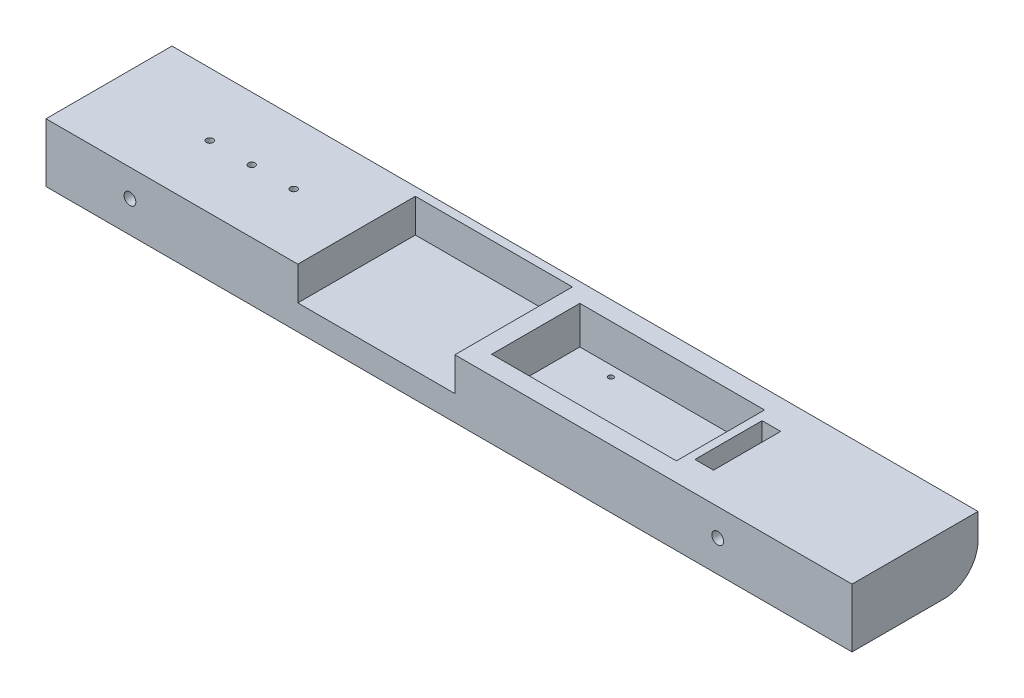
ISO-10303-21;
HEADER;
FILE_DESCRIPTION(('STEP AP214'),'2;1');
FILE_NAME('part.step','',(''),(''),'','','');
FILE_SCHEMA(('AUTOMOTIVE_DESIGN { 1 0 10303 214 1 1 1 1 }'));
ENDSEC;
DATA;
#1=APPLICATION_CONTEXT('core data for automotive mechanical design processes');
#2=APPLICATION_PROTOCOL_DEFINITION('international standard','automotive_design',2000,#1);
#3=PRODUCT_CONTEXT('',#1,'mechanical');
#4=PRODUCT('Part','Part','',(#3));
#5=PRODUCT_RELATED_PRODUCT_CATEGORY('part','',(#4));
#6=PRODUCT_DEFINITION_FORMATION('','',#4);
#7=PRODUCT_DEFINITION_CONTEXT('part definition',#1,'design');
#8=PRODUCT_DEFINITION('design','',#6,#7);
#9=PRODUCT_DEFINITION_SHAPE('','',#8);
#10=(LENGTH_UNIT() NAMED_UNIT(*) SI_UNIT(.MILLI.,.METRE.));
#11=(NAMED_UNIT(*) PLANE_ANGLE_UNIT() SI_UNIT($,.RADIAN.));
#12=(NAMED_UNIT(*) SI_UNIT($,.STERADIAN.) SOLID_ANGLE_UNIT());
#13=UNCERTAINTY_MEASURE_WITH_UNIT(LENGTH_MEASURE(1.E-05),#10,'distance_accuracy_value','');
#14=(GEOMETRIC_REPRESENTATION_CONTEXT(3) GLOBAL_UNCERTAINTY_ASSIGNED_CONTEXT((#13)) GLOBAL_UNIT_ASSIGNED_CONTEXT((#10,
#11,#12)) REPRESENTATION_CONTEXT('',''));
#15=CARTESIAN_POINT('',(0.,0.,0.));
#16=DIRECTION('',(0.,0.,1.));
#17=DIRECTION('',(1.,0.,0.));
#18=AXIS2_PLACEMENT_3D('',#15,#16,#17);
#19=CARTESIAN_POINT('',(243.84,-7.62,-27.94));
#20=DIRECTION('',(-1.,0.,0.));
#21=DIRECTION('',(0.,0.,1.));
#22=AXIS2_PLACEMENT_3D('',#19,#20,#21);
#23=CYLINDRICAL_SURFACE('',#22,10.16);
#24=DIRECTION('',(-1.,0.,0.));
#25=VECTOR('',#24,1.);
#26=CARTESIAN_POINT('',(243.84,-7.61999999999999,-38.1));
#27=LINE('',#26,#25);
#28=CARTESIAN_POINT('',(139.788543672477,-7.62,-38.1));
#29=VERTEX_POINT('',#28);
#30=CARTESIAN_POINT('',(0.,-7.61999999999999,-38.1));
#31=VERTEX_POINT('',#30);
#32=EDGE_CURVE('E406',#29,#31,#27,.T.);
#33=ORIENTED_EDGE('',*,*,#32,.F.);
#34=CARTESIAN_POINT('',(139.788543672477,-7.62,-27.94));
#35=DIRECTION('',(-1.,0.,0.));
#36=DIRECTION('',(0.,0.,-1.));
#37=AXIS2_PLACEMENT_3D('',#34,#35,#36);
#38=CIRCLE('',#37,10.16);
#39=CARTESIAN_POINT('',(139.788543672477,-17.78,-27.94));
#40=VERTEX_POINT('',#39);
#41=EDGE_CURVE('E229',#29,#40,#38,.T.);
#42=ORIENTED_EDGE('',*,*,#41,.T.);
#43=DIRECTION('',(-1.,0.,0.));
#44=VECTOR('',#43,1.);
#45=CARTESIAN_POINT('',(243.84,-17.78,-27.94));
#46=LINE('',#45,#44);
#47=CARTESIAN_POINT('',(0.,-17.78,-27.94));
#48=VERTEX_POINT('',#47);
#49=EDGE_CURVE('E204',#48,#40,#46,.F.);
#50=ORIENTED_EDGE('',*,*,#49,.F.);
#51=CARTESIAN_POINT('',(0.,-7.62,-27.94));
#52=DIRECTION('',(1.,0.,0.));
#53=DIRECTION('',(0.,0.,-1.));
#54=AXIS2_PLACEMENT_3D('',#51,#52,#53);
#55=CIRCLE('',#54,10.16);
#56=EDGE_CURVE('E208',#31,#48,#55,.F.);
#57=ORIENTED_EDGE('',*,*,#56,.F.);
#58=EDGE_LOOP('',(#33,#42,#50,#57));
#59=FACE_BOUND('',#58,.T.);
#60=ADVANCED_FACE('F33',(#59),#23,.T.);
#61=CARTESIAN_POINT('',(30.48,-10.16,-19.05));
#62=DIRECTION('',(0.,1.,0.));
#63=DIRECTION('',(0.,0.,1.));
#64=AXIS2_PLACEMENT_3D('',#61,#62,#63);
#65=PLANE('',#64);
#66=CARTESIAN_POINT('',(30.48,-10.16,-19.05));
#67=DIRECTION('',(0.,1.,0.));
#68=DIRECTION('',(0.,0.,1.));
#69=AXIS2_PLACEMENT_3D('',#66,#67,#68);
#70=CIRCLE('',#69,1.016);
#71=CARTESIAN_POINT('',(30.48,-10.16,-18.034));
#72=VERTEX_POINT('',#71);
#73=EDGE_CURVE('E403',#72,#72,#70,.T.);
#74=ORIENTED_EDGE('',*,*,#73,.T.);
#75=EDGE_LOOP('',(#74));
#76=FACE_BOUND('',#75,.T.);
#77=ADVANCED_FACE('F448',(#76),#65,.T.);
#78=CARTESIAN_POINT('',(30.48,-10.16,-19.05));
#79=DIRECTION('',(0.,1.,0.));
#80=DIRECTION('',(0.,0.,1.));
#81=AXIS2_PLACEMENT_3D('',#78,#79,#80);
#82=CYLINDRICAL_SURFACE('',#81,1.016);
#83=ORIENTED_EDGE('',*,*,#73,.F.);
#84=EDGE_LOOP('',(#83));
#85=FACE_BOUND('',#84,.T.);
#86=CARTESIAN_POINT('',(30.48,0.,-19.05));
#87=DIRECTION('',(0.,1.,0.));
#88=DIRECTION('',(0.,0.,1.));
#89=AXIS2_PLACEMENT_3D('',#86,#87,#88);
#90=CIRCLE('',#89,1.016);
#91=CARTESIAN_POINT('',(30.48,0.,-18.034));
#92=VERTEX_POINT('',#91);
#93=EDGE_CURVE('E400',#92,#92,#90,.T.);
#94=ORIENTED_EDGE('',*,*,#93,.T.);
#95=EDGE_LOOP('',(#94));
#96=FACE_BOUND('',#95,.T.);
#97=ADVANCED_FACE('F452',(#85,#96),#82,.F.);
#98=CARTESIAN_POINT('',(243.84,0.,0.));
#99=DIRECTION('',(0.,0.,-1.));
#100=DIRECTION('',(-1.,0.,0.));
#101=AXIS2_PLACEMENT_3D('',#98,#99,#100);
#102=PLANE('',#101);
#103=CARTESIAN_POINT('',(25.4,-8.25500000000002,0.));
#104=DIRECTION('',(0.,0.,1.));
#105=DIRECTION('',(1.,0.,0.));
#106=AXIS2_PLACEMENT_3D('',#103,#104,#105);
#107=CIRCLE('',#106,1.778);
#108=CARTESIAN_POINT('',(27.178,-8.25500000000002,0.));
#109=VERTEX_POINT('',#108);
#110=EDGE_CURVE('E301',#109,#109,#107,.T.);
#111=ORIENTED_EDGE('',*,*,#110,.F.);
#112=EDGE_LOOP('',(#111));
#113=FACE_BOUND('',#112,.T.);
#114=CARTESIAN_POINT('',(203.2,-8.25500000000002,0.));
#115=DIRECTION('',(0.,0.,1.));
#116=DIRECTION('',(1.,0.,0.));
#117=AXIS2_PLACEMENT_3D('',#114,#115,#116);
#118=CIRCLE('',#117,1.77800000000001);
#119=CARTESIAN_POINT('',(204.978,-8.25500000000002,0.));
#120=VERTEX_POINT('',#119);
#121=EDGE_CURVE('E294',#120,#120,#118,.T.);
#122=ORIENTED_EDGE('',*,*,#121,.F.);
#123=EDGE_LOOP('',(#122));
#124=FACE_BOUND('',#123,.T.);
#125=DIRECTION('',(1.,0.,0.));
#126=VECTOR('',#125,1.);
#127=CARTESIAN_POINT('',(76.1779458647709,-10.16,0.));
#128=LINE('',#127,#126);
#129=CARTESIAN_POINT('',(76.1779458647709,-10.16,0.));
#130=VERTEX_POINT('',#129);
#131=CARTESIAN_POINT('',(123.675945864771,-10.16,0.));
#132=VERTEX_POINT('',#131);
#133=EDGE_CURVE('E312',#130,#132,#128,.T.);
#134=ORIENTED_EDGE('',*,*,#133,.F.);
#135=DIRECTION('',(0.,1.,0.));
#136=VECTOR('',#135,1.);
#137=CARTESIAN_POINT('',(76.1779458647709,-10.16,0.));
#138=LINE('',#137,#136);
#139=CARTESIAN_POINT('',(76.1779458647709,0.,0.));
#140=VERTEX_POINT('',#139);
#141=EDGE_CURVE('E322',#130,#140,#138,.T.);
#142=ORIENTED_EDGE('',*,*,#141,.T.);
#143=DIRECTION('',(-1.,0.,0.));
#144=VECTOR('',#143,1.);
#145=CARTESIAN_POINT('',(243.84,0.,0.));
#146=LINE('',#145,#144);
#147=CARTESIAN_POINT('',(0.,0.,0.));
#148=VERTEX_POINT('',#147);
#149=EDGE_CURVE('E381',#140,#148,#146,.T.);
#150=ORIENTED_EDGE('',*,*,#149,.T.);
#151=DIRECTION('',(0.,-1.,0.));
#152=VECTOR('',#151,1.);
#153=CARTESIAN_POINT('',(0.,0.,0.));
#154=LINE('',#153,#152);
#155=CARTESIAN_POINT('',(0.,-17.78,0.));
#156=VERTEX_POINT('',#155);
#157=EDGE_CURVE('E363',#148,#156,#154,.T.);
#158=ORIENTED_EDGE('',*,*,#157,.T.);
#159=DIRECTION('',(-1.,0.,0.));
#160=VECTOR('',#159,1.);
#161=CARTESIAN_POINT('',(243.84,-17.78,0.));
#162=LINE('',#161,#160);
#163=CARTESIAN_POINT('',(243.84,-17.78,0.));
#164=VERTEX_POINT('',#163);
#165=EDGE_CURVE('E397',#164,#156,#162,.T.);
#166=ORIENTED_EDGE('',*,*,#165,.F.);
#167=DIRECTION('',(0.,-1.,0.));
#168=VECTOR('',#167,1.);
#169=CARTESIAN_POINT('',(243.84,0.,0.));
#170=LINE('',#169,#168);
#171=CARTESIAN_POINT('',(243.84,0.,0.));
#172=VERTEX_POINT('',#171);
#173=EDGE_CURVE('E370',#172,#164,#170,.T.);
#174=ORIENTED_EDGE('',*,*,#173,.F.);
#175=CARTESIAN_POINT('',(123.675945864771,0.,0.));
#176=VERTEX_POINT('',#175);
#177=EDGE_CURVE('E391',#172,#176,#146,.T.);
#178=ORIENTED_EDGE('',*,*,#177,.T.);
#179=DIRECTION('',(0.,1.,0.));
#180=VECTOR('',#179,1.);
#181=CARTESIAN_POINT('',(123.675945864771,-10.16,0.));
#182=LINE('',#181,#180);
#183=EDGE_CURVE('E334',#132,#176,#182,.T.);
#184=ORIENTED_EDGE('',*,*,#183,.F.);
#185=EDGE_LOOP('',(#134,#142,#150,#158,#166,#174,#178,#184));
#186=FACE_BOUND('',#185,.T.);
#187=ADVANCED_FACE('F509',(#113,#124,#186),#102,.F.);
#188=CARTESIAN_POINT('',(243.84,-17.78,0.));
#189=DIRECTION('',(0.,1.,0.));
#190=DIRECTION('',(0.,0.,1.));
#191=AXIS2_PLACEMENT_3D('',#188,#189,#190);
#192=PLANE('',#191);
#193=CARTESIAN_POINT('',(141.693543672477,-17.78,-29.21));
#194=DIRECTION('',(0.,1.,0.));
#195=DIRECTION('',(0.,0.,1.));
#196=AXIS2_PLACEMENT_3D('',#193,#194,#195);
#197=CIRCLE('',#196,0.762000000000004);
#198=CARTESIAN_POINT('',(141.693543672477,-17.78,-28.448));
#199=VERTEX_POINT('',#198);
#200=EDGE_CURVE('E417',#199,#199,#197,.T.);
#201=ORIENTED_EDGE('',*,*,#200,.T.);
#202=EDGE_LOOP('',(#201));
#203=FACE_BOUND('',#202,.T.);
#204=CARTESIAN_POINT('',(179.793543672477,-17.78,-29.21));
#205=DIRECTION('',(0.,1.,0.));
#206=DIRECTION('',(0.,0.,1.));
#207=AXIS2_PLACEMENT_3D('',#204,#205,#206);
#208=CIRCLE('',#207,0.762000000000003);
#209=CARTESIAN_POINT('',(179.793543672477,-17.78,-28.448));
#210=VERTEX_POINT('',#209);
#211=EDGE_CURVE('E419',#210,#210,#208,.T.);
#212=ORIENTED_EDGE('',*,*,#211,.T.);
#213=EDGE_LOOP('',(#212));
#214=FACE_BOUND('',#213,.T.);
#215=CARTESIAN_POINT('',(179.793543672477,-17.78,-8.89));
#216=DIRECTION('',(0.,-1.,0.));
#217=DIRECTION('',(0.,0.,1.));
#218=AXIS2_PLACEMENT_3D('',#215,#216,#217);
#219=CIRCLE('',#218,0.762000000000004);
#220=CARTESIAN_POINT('',(179.793543672477,-17.78,-8.128));
#221=VERTEX_POINT('',#220);
#222=EDGE_CURVE('E247',#221,#221,#219,.T.);
#223=ORIENTED_EDGE('',*,*,#222,.F.);
#224=EDGE_LOOP('',(#223));
#225=FACE_BOUND('',#224,.T.);
#226=CARTESIAN_POINT('',(141.693543672477,-17.78,-8.89));
#227=DIRECTION('',(0.,-1.,0.));
#228=DIRECTION('',(0.,0.,1.));
#229=AXIS2_PLACEMENT_3D('',#226,#227,#228);
#230=CIRCLE('',#229,0.762000000000004);
#231=CARTESIAN_POINT('',(141.693543672477,-17.78,-8.128));
#232=VERTEX_POINT('',#231);
#233=EDGE_CURVE('E240',#232,#232,#230,.T.);
#234=ORIENTED_EDGE('',*,*,#233,.F.);
#235=EDGE_LOOP('',(#234));
#236=FACE_BOUND('',#235,.T.);
#237=DIRECTION('',(0.,0.,-1.));
#238=VECTOR('',#237,1.);
#239=CARTESIAN_POINT('',(139.788543672477,-17.78,-27.94));
#240=LINE('',#239,#238);
#241=CARTESIAN_POINT('',(139.788543672477,-17.78,-31.75));
#242=VERTEX_POINT('',#241);
#243=EDGE_CURVE('E231',#40,#242,#240,.T.);
#244=ORIENTED_EDGE('',*,*,#243,.T.);
#245=DIRECTION('',(-1.,0.,0.));
#246=VECTOR('',#245,1.);
#247=CARTESIAN_POINT('',(243.84,-17.78,-31.75));
#248=LINE('',#247,#246);
#249=CARTESIAN_POINT('',(181.698543672477,-17.78,-31.75));
#250=VERTEX_POINT('',#249);
#251=EDGE_CURVE('E41',#242,#250,#248,.F.);
#252=ORIENTED_EDGE('',*,*,#251,.T.);
#253=DIRECTION('',(0.,0.,-1.));
#254=VECTOR('',#253,1.);
#255=CARTESIAN_POINT('',(181.698543672477,-17.78,-27.94));
#256=LINE('',#255,#254);
#257=CARTESIAN_POINT('',(181.698543672477,-17.78,-27.94));
#258=VERTEX_POINT('',#257);
#259=EDGE_CURVE('E180',#258,#250,#256,.T.);
#260=ORIENTED_EDGE('',*,*,#259,.F.);
#261=CARTESIAN_POINT('',(187.413543672477,-17.78,-27.94));
#262=VERTEX_POINT('',#261);
#263=EDGE_CURVE('E185',#258,#262,#46,.F.);
#264=ORIENTED_EDGE('',*,*,#263,.T.);
#265=DIRECTION('',(0.,0.,-1.));
#266=VECTOR('',#265,1.);
#267=CARTESIAN_POINT('',(187.413543672477,-17.78,-8.89000000000001));
#268=LINE('',#267,#266);
#269=CARTESIAN_POINT('',(187.413543672477,-17.78,-8.89000000000001));
#270=VERTEX_POINT('',#269);
#271=EDGE_CURVE('E254',#270,#262,#268,.T.);
#272=ORIENTED_EDGE('',*,*,#271,.F.);
#273=DIRECTION('',(-1.,0.,0.));
#274=VECTOR('',#273,1.);
#275=CARTESIAN_POINT('',(187.413543672477,-17.78,-8.89000000000001));
#276=LINE('',#275,#274);
#277=CARTESIAN_POINT('',(193.04,-17.78,-8.89000000000001));
#278=VERTEX_POINT('',#277);
#279=EDGE_CURVE('E259',#278,#270,#276,.T.);
#280=ORIENTED_EDGE('',*,*,#279,.F.);
#281=DIRECTION('',(0.,0.,1.));
#282=VECTOR('',#281,1.);
#283=CARTESIAN_POINT('',(193.04,-17.78,-8.89000000000001));
#284=LINE('',#283,#282);
#285=CARTESIAN_POINT('',(193.04,-17.78,-27.94));
#286=VERTEX_POINT('',#285);
#287=EDGE_CURVE('E270',#286,#278,#284,.T.);
#288=ORIENTED_EDGE('',*,*,#287,.F.);
#289=DIRECTION('',(-1.,0.,0.));
#290=VECTOR('',#289,1.);
#291=CARTESIAN_POINT('',(243.84,-17.78,-27.94));
#292=LINE('',#291,#290);
#293=CARTESIAN_POINT('',(243.84,-17.78,-27.94));
#294=VERTEX_POINT('',#293);
#295=EDGE_CURVE('E205',#286,#294,#292,.F.);
#296=ORIENTED_EDGE('',*,*,#295,.T.);
#297=DIRECTION('',(0.,0.,-1.));
#298=VECTOR('',#297,1.);
#299=CARTESIAN_POINT('',(243.84,-17.78,0.));
#300=LINE('',#299,#298);
#301=EDGE_CURVE('E373',#164,#294,#300,.T.);
#302=ORIENTED_EDGE('',*,*,#301,.F.);
#303=ORIENTED_EDGE('',*,*,#165,.T.);
#304=DIRECTION('',(0.,0.,-1.));
#305=VECTOR('',#304,1.);
#306=CARTESIAN_POINT('',(0.,-17.78,0.));
#307=LINE('',#306,#305);
#308=EDGE_CURVE('E384',#156,#48,#307,.T.);
#309=ORIENTED_EDGE('',*,*,#308,.T.);
#310=ORIENTED_EDGE('',*,*,#49,.T.);
#311=EDGE_LOOP('',(#244,#252,#260,#264,#272,#280,#288,#296,#302,#303,#309,#310));
#312=FACE_BOUND('',#311,.T.);
#313=ADVANCED_FACE('F182',(#203,#214,#225,#236,#312),#192,.F.);
#314=CARTESIAN_POINT('',(243.84,0.,-38.1));
#315=DIRECTION('',(0.,0.,1.));
#316=DIRECTION('',(0.,-1.,0.));
#317=AXIS2_PLACEMENT_3D('',#314,#315,#316);
#318=PLANE('',#317);
#319=DIRECTION('',(0.,1.,0.));
#320=VECTOR('',#319,1.);
#321=CARTESIAN_POINT('',(181.698543672477,-17.78,-38.1));
#322=LINE('',#321,#320);
#323=CARTESIAN_POINT('',(181.698543672477,-11.43,-38.1));
#324=VERTEX_POINT('',#323);
#325=CARTESIAN_POINT('',(181.698543672477,-7.62,-38.1));
#326=VERTEX_POINT('',#325);
#327=EDGE_CURVE('E189',#324,#326,#322,.T.);
#328=ORIENTED_EDGE('',*,*,#327,.F.);
#329=DIRECTION('',(-1.,0.,0.));
#330=VECTOR('',#329,1.);
#331=CARTESIAN_POINT('',(243.84,-11.43,-38.1));
#332=LINE('',#331,#330);
#333=CARTESIAN_POINT('',(139.788543672477,-11.43,-38.1));
#334=VERTEX_POINT('',#333);
#335=EDGE_CURVE('E219',#324,#334,#332,.T.);
#336=ORIENTED_EDGE('',*,*,#335,.T.);
#337=DIRECTION('',(0.,1.,0.));
#338=VECTOR('',#337,1.);
#339=CARTESIAN_POINT('',(139.788543672477,-17.78,-38.1));
#340=LINE('',#339,#338);
#341=EDGE_CURVE('E198',#334,#29,#340,.T.);
#342=ORIENTED_EDGE('',*,*,#341,.T.);
#343=ORIENTED_EDGE('',*,*,#32,.T.);
#344=DIRECTION('',(0.,1.,0.));
#345=VECTOR('',#344,1.);
#346=CARTESIAN_POINT('',(0.,0.,-38.1));
#347=LINE('',#346,#345);
#348=CARTESIAN_POINT('',(0.,0.,-38.1));
#349=VERTEX_POINT('',#348);
#350=EDGE_CURVE('E387',#31,#349,#347,.T.);
#351=ORIENTED_EDGE('',*,*,#350,.T.);
#352=DIRECTION('',(-1.,0.,0.));
#353=VECTOR('',#352,1.);
#354=CARTESIAN_POINT('',(243.84,0.,-38.1));
#355=LINE('',#354,#353);
#356=CARTESIAN_POINT('',(243.84,0.,-38.1));
#357=VERTEX_POINT('',#356);
#358=EDGE_CURVE('E394',#357,#349,#355,.T.);
#359=ORIENTED_EDGE('',*,*,#358,.F.);
#360=DIRECTION('',(0.,1.,0.));
#361=VECTOR('',#360,1.);
#362=CARTESIAN_POINT('',(243.84,0.,-38.1));
#363=LINE('',#362,#361);
#364=CARTESIAN_POINT('',(243.84,-7.61999999999999,-38.1));
#365=VERTEX_POINT('',#364);
#366=EDGE_CURVE('E377',#365,#357,#363,.T.);
#367=ORIENTED_EDGE('',*,*,#366,.F.);
#368=EDGE_CURVE('E407',#365,#326,#27,.T.);
#369=ORIENTED_EDGE('',*,*,#368,.T.);
#370=EDGE_LOOP('',(#328,#336,#342,#343,#351,#359,#367,#369));
#371=FACE_BOUND('',#370,.T.);
#372=ADVANCED_FACE('F224',(#371),#318,.F.);
#373=CARTESIAN_POINT('',(243.84,0.,0.));
#374=DIRECTION('',(0.,-1.,0.));
#375=DIRECTION('',(0.,0.,-1.));
#376=AXIS2_PLACEMENT_3D('',#373,#374,#375);
#377=PLANE('',#376);
#378=DIRECTION('',(-1.,0.,0.));
#379=VECTOR('',#378,1.);
#380=CARTESIAN_POINT('',(187.413543672477,0.,-8.89000000000001));
#381=LINE('',#380,#379);
#382=CARTESIAN_POINT('',(193.04,0.,-8.89000000000001));
#383=VERTEX_POINT('',#382);
#384=CARTESIAN_POINT('',(187.413543672477,0.,-8.89000000000001));
#385=VERTEX_POINT('',#384);
#386=EDGE_CURVE('E265',#383,#385,#381,.T.);
#387=ORIENTED_EDGE('',*,*,#386,.T.);
#388=DIRECTION('',(0.,0.,-1.));
#389=VECTOR('',#388,1.);
#390=CARTESIAN_POINT('',(187.413543672477,0.,-8.89000000000001));
#391=LINE('',#390,#389);
#392=CARTESIAN_POINT('',(187.413543672477,0.,-29.21));
#393=VERTEX_POINT('',#392);
#394=EDGE_CURVE('E255',#385,#393,#391,.T.);
#395=ORIENTED_EDGE('',*,*,#394,.T.);
#396=DIRECTION('',(1.,0.,0.));
#397=VECTOR('',#396,1.);
#398=CARTESIAN_POINT('',(187.413543672477,0.,-29.21));
#399=LINE('',#398,#397);
#400=CARTESIAN_POINT('',(193.04,0.,-29.21));
#401=VERTEX_POINT('',#400);
#402=EDGE_CURVE('E258',#393,#401,#399,.T.);
#403=ORIENTED_EDGE('',*,*,#402,.T.);
#404=DIRECTION('',(0.,0.,1.));
#405=VECTOR('',#404,1.);
#406=CARTESIAN_POINT('',(193.04,0.,-8.89000000000001));
#407=LINE('',#406,#405);
#408=EDGE_CURVE('E262',#401,#383,#407,.T.);
#409=ORIENTED_EDGE('',*,*,#408,.T.);
#410=EDGE_LOOP('',(#387,#395,#403,#409));
#411=FACE_BOUND('',#410,.T.);
#412=CARTESIAN_POINT('',(43.18,0.,-19.05));
#413=DIRECTION('',(0.,1.,0.));
#414=DIRECTION('',(0.,0.,1.));
#415=AXIS2_PLACEMENT_3D('',#412,#413,#414);
#416=CIRCLE('',#415,1.016);
#417=CARTESIAN_POINT('',(43.18,0.,-18.034));
#418=VERTEX_POINT('',#417);
#419=EDGE_CURVE('E276',#418,#418,#416,.T.);
#420=ORIENTED_EDGE('',*,*,#419,.F.);
#421=EDGE_LOOP('',(#420));
#422=FACE_BOUND('',#421,.T.);
#423=CARTESIAN_POINT('',(55.88,0.,-19.05));
#424=DIRECTION('',(0.,1.,0.));
#425=DIRECTION('',(0.,0.,1.));
#426=AXIS2_PLACEMENT_3D('',#423,#424,#425);
#427=CIRCLE('',#426,1.016);
#428=CARTESIAN_POINT('',(55.88,0.,-18.034));
#429=VERTEX_POINT('',#428);
#430=EDGE_CURVE('E290',#429,#429,#427,.T.);
#431=ORIENTED_EDGE('',*,*,#430,.F.);
#432=EDGE_LOOP('',(#431));
#433=FACE_BOUND('',#432,.T.);
#434=DIRECTION('',(1.,0.,0.));
#435=VECTOR('',#434,1.);
#436=CARTESIAN_POINT('',(129.104117331737,0.,-5.71500000000001));
#437=LINE('',#436,#435);
#438=CARTESIAN_POINT('',(129.104117331737,0.,-5.71500000000001));
#439=VERTEX_POINT('',#438);
#440=CARTESIAN_POINT('',(184.984117331737,0.,-5.71500000000001));
#441=VERTEX_POINT('',#440);
#442=EDGE_CURVE('E353',#439,#441,#437,.T.);
#443=ORIENTED_EDGE('',*,*,#442,.F.);
#444=DIRECTION('',(0.,0.,1.));
#445=VECTOR('',#444,1.);
#446=CARTESIAN_POINT('',(129.104117331737,0.,-32.385));
#447=LINE('',#446,#445);
#448=CARTESIAN_POINT('',(129.104117331737,0.,-32.385));
#449=VERTEX_POINT('',#448);
#450=EDGE_CURVE('E331',#449,#439,#447,.T.);
#451=ORIENTED_EDGE('',*,*,#450,.F.);
#452=DIRECTION('',(-1.,0.,0.));
#453=VECTOR('',#452,1.);
#454=CARTESIAN_POINT('',(129.104117331737,0.,-32.385));
#455=LINE('',#454,#453);
#456=CARTESIAN_POINT('',(184.984117331737,0.,-32.385));
#457=VERTEX_POINT('',#456);
#458=EDGE_CURVE('E342',#457,#449,#455,.T.);
#459=ORIENTED_EDGE('',*,*,#458,.F.);
#460=DIRECTION('',(0.,0.,-1.));
#461=VECTOR('',#460,1.);
#462=CARTESIAN_POINT('',(184.984117331737,0.,-32.385));
#463=LINE('',#462,#461);
#464=EDGE_CURVE('E356',#441,#457,#463,.T.);
#465=ORIENTED_EDGE('',*,*,#464,.F.);
#466=EDGE_LOOP('',(#443,#451,#459,#465));
#467=FACE_BOUND('',#466,.T.);
#468=ORIENTED_EDGE('',*,*,#149,.F.);
#469=DIRECTION('',(0.,0.,1.));
#470=VECTOR('',#469,1.);
#471=CARTESIAN_POINT('',(76.1779458647709,0.,0.));
#472=LINE('',#471,#470);
#473=CARTESIAN_POINT('',(76.1779458647709,0.,-35.56));
#474=VERTEX_POINT('',#473);
#475=EDGE_CURVE('E300',#474,#140,#472,.T.);
#476=ORIENTED_EDGE('',*,*,#475,.F.);
#477=DIRECTION('',(-1.,0.,0.));
#478=VECTOR('',#477,1.);
#479=CARTESIAN_POINT('',(76.1779458647709,0.,-35.56));
#480=LINE('',#479,#478);
#481=CARTESIAN_POINT('',(123.675945864771,0.,-35.56));
#482=VERTEX_POINT('',#481);
#483=EDGE_CURVE('E313',#482,#474,#480,.T.);
#484=ORIENTED_EDGE('',*,*,#483,.F.);
#485=DIRECTION('',(0.,0.,-1.));
#486=VECTOR('',#485,1.);
#487=CARTESIAN_POINT('',(123.675945864771,0.,0.));
#488=LINE('',#487,#486);
#489=EDGE_CURVE('E324',#176,#482,#488,.T.);
#490=ORIENTED_EDGE('',*,*,#489,.F.);
#491=ORIENTED_EDGE('',*,*,#177,.F.);
#492=DIRECTION('',(0.,0.,1.));
#493=VECTOR('',#492,1.);
#494=CARTESIAN_POINT('',(243.84,0.,0.));
#495=LINE('',#494,#493);
#496=EDGE_CURVE('E379',#357,#172,#495,.T.);
#497=ORIENTED_EDGE('',*,*,#496,.F.);
#498=ORIENTED_EDGE('',*,*,#358,.T.);
#499=DIRECTION('',(0.,0.,1.));
#500=VECTOR('',#499,1.);
#501=CARTESIAN_POINT('',(0.,0.,0.));
#502=LINE('',#501,#500);
#503=EDGE_CURVE('E374',#349,#148,#502,.T.);
#504=ORIENTED_EDGE('',*,*,#503,.T.);
#505=EDGE_LOOP('',(#468,#476,#484,#490,#491,#497,#498,#504));
#506=FACE_BOUND('',#505,.T.);
#507=ORIENTED_EDGE('',*,*,#93,.F.);
#508=EDGE_LOOP('',(#507));
#509=FACE_BOUND('',#508,.T.);
#510=ADVANCED_FACE('F498',(#411,#422,#433,#467,#506,#509),#377,.F.);
#511=CARTESIAN_POINT('',(243.84,0.,0.));
#512=DIRECTION('',(1.,0.,0.));
#513=DIRECTION('',(0.,0.,-1.));
#514=AXIS2_PLACEMENT_3D('',#511,#512,#513);
#515=PLANE('',#514);
#516=ORIENTED_EDGE('',*,*,#301,.T.);
#517=CARTESIAN_POINT('',(243.84,-7.62,-27.94));
#518=DIRECTION('',(1.,0.,0.));
#519=DIRECTION('',(0.,0.,-1.));
#520=AXIS2_PLACEMENT_3D('',#517,#518,#519);
#521=CIRCLE('',#520,10.16);
#522=EDGE_CURVE('E217',#294,#365,#521,.T.);
#523=ORIENTED_EDGE('',*,*,#522,.T.);
#524=ORIENTED_EDGE('',*,*,#366,.T.);
#525=ORIENTED_EDGE('',*,*,#496,.T.);
#526=ORIENTED_EDGE('',*,*,#173,.T.);
#527=EDGE_LOOP('',(#516,#523,#524,#525,#526));
#528=FACE_BOUND('',#527,.T.);
#529=ADVANCED_FACE('F572',(#528),#515,.T.);
#530=CARTESIAN_POINT('',(0.,0.,0.));
#531=DIRECTION('',(1.,0.,0.));
#532=DIRECTION('',(0.,0.,-1.));
#533=AXIS2_PLACEMENT_3D('',#530,#531,#532);
#534=PLANE('',#533);
#535=ORIENTED_EDGE('',*,*,#350,.F.);
#536=ORIENTED_EDGE('',*,*,#56,.T.);
#537=ORIENTED_EDGE('',*,*,#308,.F.);
#538=ORIENTED_EDGE('',*,*,#157,.F.);
#539=ORIENTED_EDGE('',*,*,#503,.F.);
#540=EDGE_LOOP('',(#535,#536,#537,#538,#539));
#541=FACE_BOUND('',#540,.T.);
#542=ADVANCED_FACE('F411',(#541),#534,.F.);
#543=CARTESIAN_POINT('',(129.104117331737,-11.43,-32.385));
#544=DIRECTION('',(-1.,0.,0.));
#545=DIRECTION('',(0.,0.,1.));
#546=AXIS2_PLACEMENT_3D('',#543,#544,#545);
#547=PLANE('',#546);
#548=ORIENTED_EDGE('',*,*,#450,.T.);
#549=DIRECTION('',(0.,1.,0.));
#550=VECTOR('',#549,1.);
#551=CARTESIAN_POINT('',(129.104117331737,-11.43,-5.71500000000001));
#552=LINE('',#551,#550);
#553=CARTESIAN_POINT('',(129.104117331737,-11.43,-5.71500000000001));
#554=VERTEX_POINT('',#553);
#555=EDGE_CURVE('E351',#554,#439,#552,.T.);
#556=ORIENTED_EDGE('',*,*,#555,.F.);
#557=DIRECTION('',(0.,0.,1.));
#558=VECTOR('',#557,1.);
#559=CARTESIAN_POINT('',(129.104117331737,-11.43,-32.385));
#560=LINE('',#559,#558);
#561=CARTESIAN_POINT('',(129.104117331737,-11.43,-32.385));
#562=VERTEX_POINT('',#561);
#563=EDGE_CURVE('E338',#562,#554,#560,.T.);
#564=ORIENTED_EDGE('',*,*,#563,.F.);
#565=DIRECTION('',(0.,1.,0.));
#566=VECTOR('',#565,1.);
#567=CARTESIAN_POINT('',(129.104117331737,-11.43,-32.385));
#568=LINE('',#567,#566);
#569=EDGE_CURVE('E361',#562,#449,#568,.T.);
#570=ORIENTED_EDGE('',*,*,#569,.T.);
#571=EDGE_LOOP('',(#548,#556,#564,#570));
#572=FACE_BOUND('',#571,.T.);
#573=ADVANCED_FACE('F571',(#572),#547,.F.);
#574=CARTESIAN_POINT('',(129.104117331737,-11.43,-32.385));
#575=DIRECTION('',(0.,0.,-1.));
#576=DIRECTION('',(-1.,0.,0.));
#577=AXIS2_PLACEMENT_3D('',#574,#575,#576);
#578=PLANE('',#577);
#579=ORIENTED_EDGE('',*,*,#458,.T.);
#580=ORIENTED_EDGE('',*,*,#569,.F.);
#581=DIRECTION('',(-1.,0.,0.));
#582=VECTOR('',#581,1.);
#583=CARTESIAN_POINT('',(129.104117331737,-11.43,-32.385));
#584=LINE('',#583,#582);
#585=CARTESIAN_POINT('',(184.984117331737,-11.43,-32.385));
#586=VERTEX_POINT('',#585);
#587=EDGE_CURVE('E348',#586,#562,#584,.T.);
#588=ORIENTED_EDGE('',*,*,#587,.F.);
#589=DIRECTION('',(0.,1.,0.));
#590=VECTOR('',#589,1.);
#591=CARTESIAN_POINT('',(184.984117331737,-11.43,-32.385));
#592=LINE('',#591,#590);
#593=EDGE_CURVE('E364',#586,#457,#592,.T.);
#594=ORIENTED_EDGE('',*,*,#593,.T.);
#595=EDGE_LOOP('',(#579,#580,#588,#594));
#596=FACE_BOUND('',#595,.T.);
#597=ADVANCED_FACE('F780',(#596),#578,.F.);
#598=CARTESIAN_POINT('',(184.984117331737,-11.43,-32.385));
#599=DIRECTION('',(1.,0.,0.));
#600=DIRECTION('',(0.,0.,-1.));
#601=AXIS2_PLACEMENT_3D('',#598,#599,#600);
#602=PLANE('',#601);
#603=ORIENTED_EDGE('',*,*,#464,.T.);
#604=ORIENTED_EDGE('',*,*,#593,.F.);
#605=DIRECTION('',(0.,0.,-1.));
#606=VECTOR('',#605,1.);
#607=CARTESIAN_POINT('',(184.984117331737,-11.43,-32.385));
#608=LINE('',#607,#606);
#609=CARTESIAN_POINT('',(184.984117331737,-11.43,-5.71500000000001));
#610=VERTEX_POINT('',#609);
#611=EDGE_CURVE('E345',#610,#586,#608,.T.);
#612=ORIENTED_EDGE('',*,*,#611,.F.);
#613=DIRECTION('',(0.,1.,0.));
#614=VECTOR('',#613,1.);
#615=CARTESIAN_POINT('',(184.984117331737,-11.43,-5.71500000000001));
#616=LINE('',#615,#614);
#617=EDGE_CURVE('E366',#610,#441,#616,.T.);
#618=ORIENTED_EDGE('',*,*,#617,.T.);
#619=EDGE_LOOP('',(#603,#604,#612,#618));
#620=FACE_BOUND('',#619,.T.);
#621=ADVANCED_FACE('F770',(#620),#602,.F.);
#622=CARTESIAN_POINT('',(129.104117331737,-11.43,-5.71500000000001));
#623=DIRECTION('',(0.,0.,1.));
#624=DIRECTION('',(1.,0.,0.));
#625=AXIS2_PLACEMENT_3D('',#622,#623,#624);
#626=PLANE('',#625);
#627=ORIENTED_EDGE('',*,*,#442,.T.);
#628=ORIENTED_EDGE('',*,*,#617,.F.);
#629=DIRECTION('',(1.,0.,0.));
#630=VECTOR('',#629,1.);
#631=CARTESIAN_POINT('',(129.104117331737,-11.43,-5.71500000000001));
#632=LINE('',#631,#630);
#633=EDGE_CURVE('E341',#554,#610,#632,.T.);
#634=ORIENTED_EDGE('',*,*,#633,.F.);
#635=ORIENTED_EDGE('',*,*,#555,.T.);
#636=EDGE_LOOP('',(#627,#628,#634,#635));
#637=FACE_BOUND('',#636,.T.);
#638=ADVANCED_FACE('F630',(#637),#626,.F.);
#639=CARTESIAN_POINT('',(0.,-11.43,0.));
#640=DIRECTION('',(0.,1.,0.));
#641=DIRECTION('',(0.,0.,1.));
#642=AXIS2_PLACEMENT_3D('',#639,#640,#641);
#643=PLANE('',#642);
#644=CARTESIAN_POINT('',(179.793543672477,-11.43,-8.89));
#645=DIRECTION('',(0.,-1.,0.));
#646=DIRECTION('',(0.,0.,1.));
#647=AXIS2_PLACEMENT_3D('',#644,#645,#646);
#648=CIRCLE('',#647,0.762000000000004);
#649=CARTESIAN_POINT('',(179.793543672477,-11.43,-8.128));
#650=VERTEX_POINT('',#649);
#651=EDGE_CURVE('E243',#650,#650,#648,.T.);
#652=ORIENTED_EDGE('',*,*,#651,.T.);
#653=EDGE_LOOP('',(#652));
#654=FACE_BOUND('',#653,.T.);
#655=CARTESIAN_POINT('',(141.693543672477,-11.43,-29.21));
#656=DIRECTION('',(0.,-1.,0.));
#657=DIRECTION('',(0.,0.,1.));
#658=AXIS2_PLACEMENT_3D('',#655,#656,#657);
#659=CIRCLE('',#658,0.762000000000004);
#660=CARTESIAN_POINT('',(141.693543672477,-11.43,-28.448));
#661=VERTEX_POINT('',#660);
#662=EDGE_CURVE('E239',#661,#661,#659,.T.);
#663=ORIENTED_EDGE('',*,*,#662,.T.);
#664=EDGE_LOOP('',(#663));
#665=FACE_BOUND('',#664,.T.);
#666=CARTESIAN_POINT('',(141.693543672477,-11.43,-8.89));
#667=DIRECTION('',(0.,-1.,0.));
#668=DIRECTION('',(0.,0.,1.));
#669=AXIS2_PLACEMENT_3D('',#666,#667,#668);
#670=CIRCLE('',#669,0.762000000000004);
#671=CARTESIAN_POINT('',(141.693543672477,-11.43,-8.128));
#672=VERTEX_POINT('',#671);
#673=EDGE_CURVE('E236',#672,#672,#670,.T.);
#674=ORIENTED_EDGE('',*,*,#673,.T.);
#675=EDGE_LOOP('',(#674));
#676=FACE_BOUND('',#675,.T.);
#677=CARTESIAN_POINT('',(179.793543672477,-11.43,-29.21));
#678=DIRECTION('',(0.,-1.,0.));
#679=DIRECTION('',(0.,0.,1.));
#680=AXIS2_PLACEMENT_3D('',#677,#678,#679);
#681=CIRCLE('',#680,0.762000000000004);
#682=CARTESIAN_POINT('',(179.793543672477,-11.43,-28.448));
#683=VERTEX_POINT('',#682);
#684=EDGE_CURVE('E246',#683,#683,#681,.T.);
#685=ORIENTED_EDGE('',*,*,#684,.T.);
#686=EDGE_LOOP('',(#685));
#687=FACE_BOUND('',#686,.T.);
#688=ORIENTED_EDGE('',*,*,#563,.T.);
#689=ORIENTED_EDGE('',*,*,#633,.T.);
#690=ORIENTED_EDGE('',*,*,#611,.T.);
#691=ORIENTED_EDGE('',*,*,#587,.T.);
#692=EDGE_LOOP('',(#688,#689,#690,#691));
#693=FACE_BOUND('',#692,.T.);
#694=ADVANCED_FACE('F624',(#654,#665,#676,#687,#693),#643,.T.);
#695=CARTESIAN_POINT('',(76.1779458647709,-10.16,0.));
#696=DIRECTION('',(-1.,0.,0.));
#697=DIRECTION('',(0.,0.,1.));
#698=AXIS2_PLACEMENT_3D('',#695,#696,#697);
#699=PLANE('',#698);
#700=ORIENTED_EDGE('',*,*,#475,.T.);
#701=ORIENTED_EDGE('',*,*,#141,.F.);
#702=DIRECTION('',(0.,0.,1.));
#703=VECTOR('',#702,1.);
#704=CARTESIAN_POINT('',(76.1779458647709,-10.16,0.));
#705=LINE('',#704,#703);
#706=CARTESIAN_POINT('',(76.1779458647709,-10.16,-35.56));
#707=VERTEX_POINT('',#706);
#708=EDGE_CURVE('E309',#707,#130,#705,.T.);
#709=ORIENTED_EDGE('',*,*,#708,.F.);
#710=DIRECTION('',(0.,1.,0.));
#711=VECTOR('',#710,1.);
#712=CARTESIAN_POINT('',(76.1779458647709,-10.16,-35.56));
#713=LINE('',#712,#711);
#714=EDGE_CURVE('E329',#707,#474,#713,.T.);
#715=ORIENTED_EDGE('',*,*,#714,.T.);
#716=EDGE_LOOP('',(#700,#701,#709,#715));
#717=FACE_BOUND('',#716,.T.);
#718=ADVANCED_FACE('F629',(#717),#699,.F.);
#719=CARTESIAN_POINT('',(76.1779458647709,-10.16,-35.56));
#720=DIRECTION('',(0.,0.,-1.));
#721=DIRECTION('',(-1.,0.,0.));
#722=AXIS2_PLACEMENT_3D('',#719,#720,#721);
#723=PLANE('',#722);
#724=ORIENTED_EDGE('',*,*,#483,.T.);
#725=ORIENTED_EDGE('',*,*,#714,.F.);
#726=DIRECTION('',(-1.,0.,0.));
#727=VECTOR('',#726,1.);
#728=CARTESIAN_POINT('',(76.1779458647709,-10.16,-35.56));
#729=LINE('',#728,#727);
#730=CARTESIAN_POINT('',(123.675945864771,-10.16,-35.56));
#731=VERTEX_POINT('',#730);
#732=EDGE_CURVE('E319',#731,#707,#729,.T.);
#733=ORIENTED_EDGE('',*,*,#732,.F.);
#734=DIRECTION('',(0.,1.,0.));
#735=VECTOR('',#734,1.);
#736=CARTESIAN_POINT('',(123.675945864771,-10.16,-35.56));
#737=LINE('',#736,#735);
#738=EDGE_CURVE('E332',#731,#482,#737,.T.);
#739=ORIENTED_EDGE('',*,*,#738,.T.);
#740=EDGE_LOOP('',(#724,#725,#733,#739));
#741=FACE_BOUND('',#740,.T.);
#742=ADVANCED_FACE('F746',(#741),#723,.F.);
#743=CARTESIAN_POINT('',(123.675945864771,-10.16,0.));
#744=DIRECTION('',(1.,0.,0.));
#745=DIRECTION('',(0.,0.,-1.));
#746=AXIS2_PLACEMENT_3D('',#743,#744,#745);
#747=PLANE('',#746);
#748=ORIENTED_EDGE('',*,*,#489,.T.);
#749=ORIENTED_EDGE('',*,*,#738,.F.);
#750=DIRECTION('',(0.,0.,-1.));
#751=VECTOR('',#750,1.);
#752=CARTESIAN_POINT('',(123.675945864771,-10.16,0.));
#753=LINE('',#752,#751);
#754=EDGE_CURVE('E316',#132,#731,#753,.T.);
#755=ORIENTED_EDGE('',*,*,#754,.F.);
#756=ORIENTED_EDGE('',*,*,#183,.T.);
#757=EDGE_LOOP('',(#748,#749,#755,#756));
#758=FACE_BOUND('',#757,.T.);
#759=ADVANCED_FACE('F736',(#758),#747,.F.);
#760=CARTESIAN_POINT('',(0.,-10.16,0.));
#761=DIRECTION('',(0.,-1.,0.));
#762=DIRECTION('',(0.,0.,-1.));
#763=AXIS2_PLACEMENT_3D('',#760,#761,#762);
#764=PLANE('',#763);
#765=ORIENTED_EDGE('',*,*,#708,.T.);
#766=ORIENTED_EDGE('',*,*,#133,.T.);
#767=ORIENTED_EDGE('',*,*,#754,.T.);
#768=ORIENTED_EDGE('',*,*,#732,.T.);
#769=EDGE_LOOP('',(#765,#766,#767,#768));
#770=FACE_BOUND('',#769,.T.);
#771=ADVANCED_FACE('F595',(#770),#764,.F.);
#772=CARTESIAN_POINT('',(203.2,-8.25500000000002,-25.4));
#773=DIRECTION('',(0.,0.,1.));
#774=DIRECTION('',(1.,0.,0.));
#775=AXIS2_PLACEMENT_3D('',#772,#773,#774);
#776=CYLINDRICAL_SURFACE('',#775,1.77800000000001);
#777=CARTESIAN_POINT('',(201.422,-8.25500000000002,-8.89));
#778=VERTEX_POINT('',#777);
#779=VERTEX_LOOP('',#778);
#780=FACE_BOUND('',#779,.T.);
#781=CARTESIAN_POINT('',(203.2,-8.25500000000002,-25.4));
#782=DIRECTION('',(0.,0.,1.));
#783=DIRECTION('',(1.,0.,0.));
#784=AXIS2_PLACEMENT_3D('',#781,#782,#783);
#785=CIRCLE('',#784,1.77800000000001);
#786=CARTESIAN_POINT('',(204.978,-8.25500000000002,-25.4));
#787=VERTEX_POINT('',#786);
#788=EDGE_CURVE('E304',#787,#787,#785,.T.);
#789=ORIENTED_EDGE('',*,*,#788,.F.);
#790=EDGE_LOOP('',(#789));
#791=FACE_BOUND('',#790,.T.);
#792=ORIENTED_EDGE('',*,*,#121,.T.);
#793=EDGE_LOOP('',(#792));
#794=FACE_BOUND('',#793,.T.);
#795=ADVANCED_FACE('F589',(#780,#791,#794),#776,.F.);
#796=CARTESIAN_POINT('',(203.2,-8.25500000000002,-25.4));
#797=DIRECTION('',(0.,0.,1.));
#798=DIRECTION('',(1.,0.,0.));
#799=AXIS2_PLACEMENT_3D('',#796,#797,#798);
#800=PLANE('',#799);
#801=ORIENTED_EDGE('',*,*,#788,.T.);
#802=EDGE_LOOP('',(#801));
#803=FACE_BOUND('',#802,.T.);
#804=ADVANCED_FACE('F594',(#803),#800,.T.);
#805=CARTESIAN_POINT('',(25.4,-8.25500000000002,-25.4));
#806=DIRECTION('',(0.,0.,1.));
#807=DIRECTION('',(1.,0.,0.));
#808=AXIS2_PLACEMENT_3D('',#805,#806,#807);
#809=CYLINDRICAL_SURFACE('',#808,1.778);
#810=CARTESIAN_POINT('',(25.4,-8.25500000000002,-25.4));
#811=DIRECTION('',(0.,0.,1.));
#812=DIRECTION('',(1.,0.,0.));
#813=AXIS2_PLACEMENT_3D('',#810,#811,#812);
#814=CIRCLE('',#813,1.778);
#815=CARTESIAN_POINT('',(27.178,-8.25500000000002,-25.4));
#816=VERTEX_POINT('',#815);
#817=EDGE_CURVE('E297',#816,#816,#814,.T.);
#818=ORIENTED_EDGE('',*,*,#817,.F.);
#819=EDGE_LOOP('',(#818));
#820=FACE_BOUND('',#819,.T.);
#821=ORIENTED_EDGE('',*,*,#110,.T.);
#822=EDGE_LOOP('',(#821));
#823=FACE_BOUND('',#822,.T.);
#824=ADVANCED_FACE('F703',(#820,#823),#809,.F.);
#825=CARTESIAN_POINT('',(25.4,-8.25500000000002,-25.4));
#826=DIRECTION('',(0.,0.,1.));
#827=DIRECTION('',(1.,0.,0.));
#828=AXIS2_PLACEMENT_3D('',#825,#826,#827);
#829=PLANE('',#828);
#830=ORIENTED_EDGE('',*,*,#817,.T.);
#831=EDGE_LOOP('',(#830));
#832=FACE_BOUND('',#831,.T.);
#833=ADVANCED_FACE('F693',(#832),#829,.T.);
#834=CARTESIAN_POINT('',(55.88,-10.16,-19.05));
#835=DIRECTION('',(0.,1.,0.));
#836=DIRECTION('',(0.,0.,1.));
#837=AXIS2_PLACEMENT_3D('',#834,#835,#836);
#838=CYLINDRICAL_SURFACE('',#837,1.016);
#839=CARTESIAN_POINT('',(55.88,-10.16,-19.05));
#840=DIRECTION('',(0.,1.,0.));
#841=DIRECTION('',(0.,0.,1.));
#842=AXIS2_PLACEMENT_3D('',#839,#840,#841);
#843=CIRCLE('',#842,1.016);
#844=CARTESIAN_POINT('',(55.88,-10.16,-18.034));
#845=VERTEX_POINT('',#844);
#846=EDGE_CURVE('E291',#845,#845,#843,.T.);
#847=ORIENTED_EDGE('',*,*,#846,.F.);
#848=EDGE_LOOP('',(#847));
#849=FACE_BOUND('',#848,.T.);
#850=ORIENTED_EDGE('',*,*,#430,.T.);
#851=EDGE_LOOP('',(#850));
#852=FACE_BOUND('',#851,.T.);
#853=ADVANCED_FACE('F683',(#849,#852),#838,.F.);
#854=CARTESIAN_POINT('',(55.88,-10.16,-19.05));
#855=DIRECTION('',(0.,1.,0.));
#856=DIRECTION('',(0.,0.,1.));
#857=AXIS2_PLACEMENT_3D('',#854,#855,#856);
#858=PLANE('',#857);
#859=ORIENTED_EDGE('',*,*,#846,.T.);
#860=EDGE_LOOP('',(#859));
#861=FACE_BOUND('',#860,.T.);
#862=ADVANCED_FACE('F658',(#861),#858,.T.);
#863=CARTESIAN_POINT('',(43.18,-10.16,-19.05));
#864=DIRECTION('',(0.,1.,0.));
#865=DIRECTION('',(0.,0.,1.));
#866=AXIS2_PLACEMENT_3D('',#863,#864,#865);
#867=CYLINDRICAL_SURFACE('',#866,1.016);
#868=CARTESIAN_POINT('',(43.18,-10.16,-19.05));
#869=DIRECTION('',(0.,1.,0.));
#870=DIRECTION('',(0.,0.,1.));
#871=AXIS2_PLACEMENT_3D('',#868,#869,#870);
#872=CIRCLE('',#871,1.016);
#873=CARTESIAN_POINT('',(43.18,-10.16,-18.034));
#874=VERTEX_POINT('',#873);
#875=EDGE_CURVE('E287',#874,#874,#872,.T.);
#876=ORIENTED_EDGE('',*,*,#875,.F.);
#877=EDGE_LOOP('',(#876));
#878=FACE_BOUND('',#877,.T.);
#879=ORIENTED_EDGE('',*,*,#419,.T.);
#880=EDGE_LOOP('',(#879));
#881=FACE_BOUND('',#880,.T.);
#882=ADVANCED_FACE('F648',(#878,#881),#867,.F.);
#883=CARTESIAN_POINT('',(43.18,-10.16,-19.05));
#884=DIRECTION('',(0.,1.,0.));
#885=DIRECTION('',(0.,0.,1.));
#886=AXIS2_PLACEMENT_3D('',#883,#884,#885);
#887=PLANE('',#886);
#888=ORIENTED_EDGE('',*,*,#875,.T.);
#889=EDGE_LOOP('',(#888));
#890=FACE_BOUND('',#889,.T.);
#891=ADVANCED_FACE('F559',(#890),#887,.T.);
#892=CARTESIAN_POINT('',(187.413543672477,0.,-8.89000000000001));
#893=DIRECTION('',(-1.,0.,0.));
#894=DIRECTION('',(0.,0.,1.));
#895=AXIS2_PLACEMENT_3D('',#892,#893,#894);
#896=PLANE('',#895);
#897=ORIENTED_EDGE('',*,*,#271,.T.);
#898=CARTESIAN_POINT('',(187.413543672477,-7.62,-27.94));
#899=DIRECTION('',(-1.,0.,0.));
#900=DIRECTION('',(0.,0.,1.));
#901=AXIS2_PLACEMENT_3D('',#898,#899,#900);
#902=CIRCLE('',#901,10.16);
#903=CARTESIAN_POINT('',(187.413543672477,-17.7003124951561,-29.21));
#904=VERTEX_POINT('',#903);
#905=EDGE_CURVE('E203',#262,#904,#902,.F.);
#906=ORIENTED_EDGE('',*,*,#905,.T.);
#907=DIRECTION('',(0.,-1.,0.));
#908=VECTOR('',#907,1.);
#909=CARTESIAN_POINT('',(187.413543672477,0.,-29.21));
#910=LINE('',#909,#908);
#911=EDGE_CURVE('E268',#393,#904,#910,.T.);
#912=ORIENTED_EDGE('',*,*,#911,.F.);
#913=ORIENTED_EDGE('',*,*,#394,.F.);
#914=DIRECTION('',(0.,-1.,0.));
#915=VECTOR('',#914,1.);
#916=CARTESIAN_POINT('',(187.413543672477,0.,-8.89000000000001));
#917=LINE('',#916,#915);
#918=EDGE_CURVE('E274',#385,#270,#917,.T.);
#919=ORIENTED_EDGE('',*,*,#918,.T.);
#920=EDGE_LOOP('',(#897,#906,#912,#913,#919));
#921=FACE_BOUND('',#920,.T.);
#922=ADVANCED_FACE('F554',(#921),#896,.F.);
#923=CARTESIAN_POINT('',(187.413543672477,0.,-8.89000000000001));
#924=DIRECTION('',(0.,0.,1.));
#925=DIRECTION('',(1.,0.,0.));
#926=AXIS2_PLACEMENT_3D('',#923,#924,#925);
#927=PLANE('',#926);
#928=ORIENTED_EDGE('',*,*,#279,.T.);
#929=ORIENTED_EDGE('',*,*,#918,.F.);
#930=ORIENTED_EDGE('',*,*,#386,.F.);
#931=DIRECTION('',(0.,-1.,0.));
#932=VECTOR('',#931,1.);
#933=CARTESIAN_POINT('',(193.04,0.,-8.89000000000001));
#934=LINE('',#933,#932);
#935=EDGE_CURVE('E277',#383,#278,#934,.T.);
#936=ORIENTED_EDGE('',*,*,#935,.T.);
#937=EDGE_LOOP('',(#928,#929,#930,#936));
#938=FACE_BOUND('',#937,.T.);
#939=ADVANCED_FACE('F546',(#938),#927,.F.);
#940=CARTESIAN_POINT('',(193.04,0.,-8.89000000000001));
#941=DIRECTION('',(1.,0.,0.));
#942=DIRECTION('',(0.,0.,-1.));
#943=AXIS2_PLACEMENT_3D('',#940,#941,#942);
#944=PLANE('',#943);
#945=DIRECTION('',(0.,-1.,0.));
#946=VECTOR('',#945,1.);
#947=CARTESIAN_POINT('',(193.04,0.,-29.21));
#948=LINE('',#947,#946);
#949=CARTESIAN_POINT('',(193.04,-17.7003124951561,-29.21));
#950=VERTEX_POINT('',#949);
#951=EDGE_CURVE('E280',#401,#950,#948,.T.);
#952=ORIENTED_EDGE('',*,*,#951,.T.);
#953=CARTESIAN_POINT('',(193.04,-7.62,-27.94));
#954=DIRECTION('',(1.,0.,0.));
#955=DIRECTION('',(0.,0.,-1.));
#956=AXIS2_PLACEMENT_3D('',#953,#954,#955);
#957=CIRCLE('',#956,10.16);
#958=EDGE_CURVE('E215',#950,#286,#957,.F.);
#959=ORIENTED_EDGE('',*,*,#958,.T.);
#960=ORIENTED_EDGE('',*,*,#287,.T.);
#961=ORIENTED_EDGE('',*,*,#935,.F.);
#962=ORIENTED_EDGE('',*,*,#408,.F.);
#963=EDGE_LOOP('',(#952,#959,#960,#961,#962));
#964=FACE_BOUND('',#963,.T.);
#965=ADVANCED_FACE('F441',(#964),#944,.F.);
#966=CARTESIAN_POINT('',(187.413543672477,0.,-29.21));
#967=DIRECTION('',(0.,0.,-1.));
#968=DIRECTION('',(-1.,0.,0.));
#969=AXIS2_PLACEMENT_3D('',#966,#967,#968);
#970=PLANE('',#969);
#971=ORIENTED_EDGE('',*,*,#911,.T.);
#972=DIRECTION('',(-1.,0.,0.));
#973=VECTOR('',#972,1.);
#974=CARTESIAN_POINT('',(187.413543672477,-17.7003124951561,-29.21));
#975=LINE('',#974,#973);
#976=EDGE_CURVE('E213',#904,#950,#975,.F.);
#977=ORIENTED_EDGE('',*,*,#976,.T.);
#978=ORIENTED_EDGE('',*,*,#951,.F.);
#979=ORIENTED_EDGE('',*,*,#402,.F.);
#980=EDGE_LOOP('',(#971,#977,#978,#979));
#981=FACE_BOUND('',#980,.T.);
#982=ADVANCED_FACE('F431',(#981),#970,.F.);
#983=CARTESIAN_POINT('',(179.793543672477,-11.43,-29.21));
#984=DIRECTION('',(0.,-1.,0.));
#985=DIRECTION('',(0.,0.,-1.));
#986=AXIS2_PLACEMENT_3D('',#983,#984,#985);
#987=CYLINDRICAL_SURFACE('',#986,0.762000000000004);
#988=ORIENTED_EDGE('',*,*,#684,.F.);
#989=EDGE_LOOP('',(#988));
#990=FACE_BOUND('',#989,.T.);
#991=ORIENTED_EDGE('',*,*,#211,.F.);
#992=EDGE_LOOP('',(#991));
#993=FACE_BOUND('',#992,.T.);
#994=ADVANCED_FACE('F428',(#990,#993),#987,.F.);
#995=CARTESIAN_POINT('',(141.693543672477,-11.43,-8.89));
#996=DIRECTION('',(0.,-1.,0.));
#997=DIRECTION('',(0.,0.,-1.));
#998=AXIS2_PLACEMENT_3D('',#995,#996,#997);
#999=CYLINDRICAL_SURFACE('',#998,0.762000000000004);
#1000=ORIENTED_EDGE('',*,*,#673,.F.);
#1001=EDGE_LOOP('',(#1000));
#1002=FACE_BOUND('',#1001,.T.);
#1003=ORIENTED_EDGE('',*,*,#233,.T.);
#1004=EDGE_LOOP('',(#1003));
#1005=FACE_BOUND('',#1004,.T.);
#1006=ADVANCED_FACE('F430',(#1002,#1005),#999,.F.);
#1007=CARTESIAN_POINT('',(141.693543672477,-11.43,-29.21));
#1008=DIRECTION('',(0.,-1.,0.));
#1009=DIRECTION('',(0.,0.,-1.));
#1010=AXIS2_PLACEMENT_3D('',#1007,#1008,#1009);
#1011=CYLINDRICAL_SURFACE('',#1010,0.762000000000004);
#1012=ORIENTED_EDGE('',*,*,#662,.F.);
#1013=EDGE_LOOP('',(#1012));
#1014=FACE_BOUND('',#1013,.T.);
#1015=ORIENTED_EDGE('',*,*,#200,.F.);
#1016=EDGE_LOOP('',(#1015));
#1017=FACE_BOUND('',#1016,.T.);
#1018=ADVANCED_FACE('F438',(#1014,#1017),#1011,.F.);
#1019=CARTESIAN_POINT('',(179.793543672477,-11.43,-8.89));
#1020=DIRECTION('',(0.,-1.,0.));
#1021=DIRECTION('',(0.,0.,-1.));
#1022=AXIS2_PLACEMENT_3D('',#1019,#1020,#1021);
#1023=CYLINDRICAL_SURFACE('',#1022,0.762000000000004);
#1024=ORIENTED_EDGE('',*,*,#651,.F.);
#1025=EDGE_LOOP('',(#1024));
#1026=FACE_BOUND('',#1025,.T.);
#1027=ORIENTED_EDGE('',*,*,#222,.T.);
#1028=EDGE_LOOP('',(#1027));
#1029=FACE_BOUND('',#1028,.T.);
#1030=ADVANCED_FACE('F456',(#1026,#1029),#1023,.F.);
#1031=CARTESIAN_POINT('',(181.698543672477,-7.62,-27.94));
#1032=DIRECTION('',(-1.,0.,0.));
#1033=DIRECTION('',(0.,0.,-1.));
#1034=AXIS2_PLACEMENT_3D('',#1031,#1032,#1033);
#1035=CIRCLE('',#1034,10.16);
#1036=EDGE_CURVE('E190',#326,#258,#1035,.T.);
#1037=ORIENTED_EDGE('',*,*,#1036,.F.);
#1038=ORIENTED_EDGE('',*,*,#368,.F.);
#1039=ORIENTED_EDGE('',*,*,#522,.F.);
#1040=ORIENTED_EDGE('',*,*,#295,.F.);
#1041=ORIENTED_EDGE('',*,*,#958,.F.);
#1042=ORIENTED_EDGE('',*,*,#976,.F.);
#1043=ORIENTED_EDGE('',*,*,#905,.F.);
#1044=ORIENTED_EDGE('',*,*,#263,.F.);
#1045=EDGE_LOOP('',(#1037,#1038,#1039,#1040,#1041,#1042,#1043,#1044));
#1046=FACE_BOUND('',#1045,.T.);
#1047=ADVANCED_FACE('F201',(#1046),#23,.T.);
#1048=CARTESIAN_POINT('',(181.698543672477,-7.62,-27.94));
#1049=DIRECTION('',(1.,0.,0.));
#1050=DIRECTION('',(0.,0.,-1.));
#1051=AXIS2_PLACEMENT_3D('',#1048,#1049,#1050);
#1052=PLANE('',#1051);
#1053=ORIENTED_EDGE('',*,*,#259,.T.);
#1054=CARTESIAN_POINT('',(181.698543672477,-11.43,-31.75));
#1055=DIRECTION('',(1.,0.,0.));
#1056=DIRECTION('',(0.,0.,-1.));
#1057=AXIS2_PLACEMENT_3D('',#1054,#1055,#1056);
#1058=CIRCLE('',#1057,6.35);
#1059=EDGE_CURVE('E11',#250,#324,#1058,.T.);
#1060=ORIENTED_EDGE('',*,*,#1059,.T.);
#1061=ORIENTED_EDGE('',*,*,#327,.T.);
#1062=ORIENTED_EDGE('',*,*,#1036,.T.);
#1063=EDGE_LOOP('',(#1053,#1060,#1061,#1062));
#1064=FACE_BOUND('',#1063,.T.);
#1065=ADVANCED_FACE('F193',(#1064),#1052,.T.);
#1066=CARTESIAN_POINT('',(139.788543672477,-7.62,-27.94));
#1067=DIRECTION('',(1.,0.,0.));
#1068=DIRECTION('',(0.,0.,-1.));
#1069=AXIS2_PLACEMENT_3D('',#1066,#1067,#1068);
#1070=PLANE('',#1069);
#1071=ORIENTED_EDGE('',*,*,#341,.F.);
#1072=CARTESIAN_POINT('',(139.788543672477,-11.43,-31.75));
#1073=DIRECTION('',(1.,0.,0.));
#1074=DIRECTION('',(0.,0.,-1.));
#1075=AXIS2_PLACEMENT_3D('',#1072,#1073,#1074);
#1076=CIRCLE('',#1075,6.35);
#1077=EDGE_CURVE('E55',#334,#242,#1076,.F.);
#1078=ORIENTED_EDGE('',*,*,#1077,.T.);
#1079=ORIENTED_EDGE('',*,*,#243,.F.);
#1080=ORIENTED_EDGE('',*,*,#41,.F.);
#1081=EDGE_LOOP('',(#1071,#1078,#1079,#1080));
#1082=FACE_BOUND('',#1081,.T.);
#1083=ADVANCED_FACE('F227',(#1082),#1070,.F.);
#1084=CARTESIAN_POINT('',(243.84,-11.43,-31.75));
#1085=DIRECTION('',(-1.,0.,0.));
#1086=DIRECTION('',(0.,0.,1.));
#1087=AXIS2_PLACEMENT_3D('',#1084,#1085,#1086);
#1088=CYLINDRICAL_SURFACE('',#1087,6.35);
#1089=ORIENTED_EDGE('',*,*,#1059,.F.);
#1090=ORIENTED_EDGE('',*,*,#251,.F.);
#1091=ORIENTED_EDGE('',*,*,#1077,.F.);
#1092=ORIENTED_EDGE('',*,*,#335,.F.);
#1093=EDGE_LOOP('',(#1089,#1090,#1091,#1092));
#1094=FACE_BOUND('',#1093,.T.);
#1095=ADVANCED_FACE('F35',(#1094),#1088,.T.);
#1096=CLOSED_SHELL('',(#60,#77,#97,#187,#313,#372,#510,#529,#542,#573,#597,#621,#638,#694,#718,
#742,#759,#771,#795,#804,#824,#833,#853,#862,#882,#891,#922,#939,#965,#982,#994,#1006,#1018,
#1030,#1047,#1065,#1083,#1095));
#1097=MANIFOLD_SOLID_BREP('B2',#1096);
#1098=ADVANCED_BREP_SHAPE_REPRESENTATION('',(#18,#1097),#14);
#1099=SHAPE_DEFINITION_REPRESENTATION(#9,#1098);
ENDSEC;
END-ISO-10303-21;
